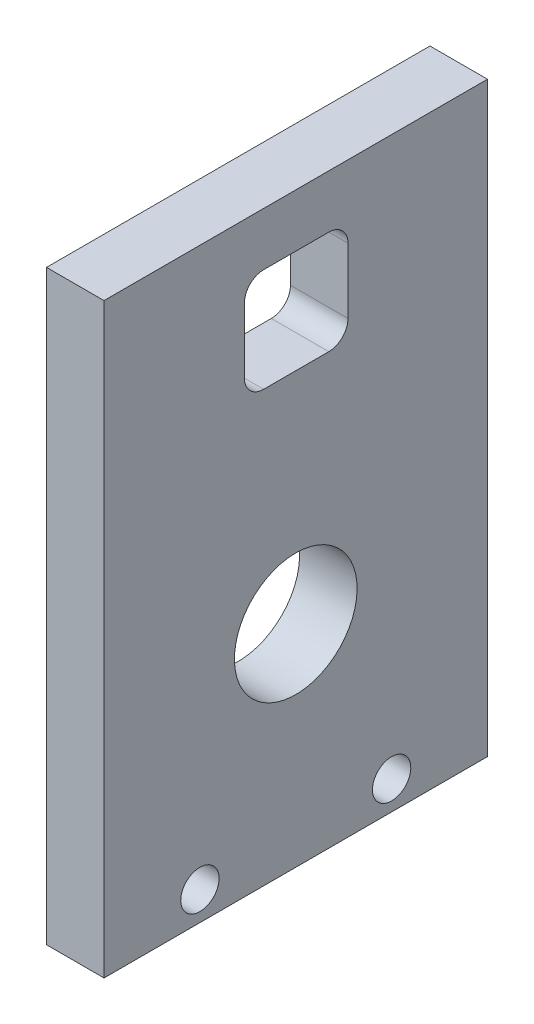
ISO-10303-21;
HEADER;
FILE_DESCRIPTION(('STEP AP214'),'2;1');
FILE_NAME('part.step','',(''),(''),'','','');
FILE_SCHEMA(('AUTOMOTIVE_DESIGN { 1 0 10303 214 1 1 1 1 }'));
ENDSEC;
DATA;
#1=APPLICATION_CONTEXT('core data for automotive mechanical design processes');
#2=APPLICATION_PROTOCOL_DEFINITION('international standard','automotive_design',2000,#1);
#3=PRODUCT_CONTEXT('',#1,'mechanical');
#4=PRODUCT('Part','Part','',(#3));
#5=PRODUCT_RELATED_PRODUCT_CATEGORY('part','',(#4));
#6=PRODUCT_DEFINITION_FORMATION('','',#4);
#7=PRODUCT_DEFINITION_CONTEXT('part definition',#1,'design');
#8=PRODUCT_DEFINITION('design','',#6,#7);
#9=PRODUCT_DEFINITION_SHAPE('','',#8);
#10=(LENGTH_UNIT() NAMED_UNIT(*) SI_UNIT(.MILLI.,.METRE.));
#11=(NAMED_UNIT(*) PLANE_ANGLE_UNIT() SI_UNIT($,.RADIAN.));
#12=(NAMED_UNIT(*) SI_UNIT($,.STERADIAN.) SOLID_ANGLE_UNIT());
#13=UNCERTAINTY_MEASURE_WITH_UNIT(LENGTH_MEASURE(1.E-05),#10,'distance_accuracy_value','');
#14=(GEOMETRIC_REPRESENTATION_CONTEXT(3) GLOBAL_UNCERTAINTY_ASSIGNED_CONTEXT((#13)) GLOBAL_UNIT_ASSIGNED_CONTEXT((#10,
#11,#12)) REPRESENTATION_CONTEXT('',''));
#15=CARTESIAN_POINT('',(0.,0.,0.));
#16=DIRECTION('',(0.,0.,1.));
#17=DIRECTION('',(1.,0.,0.));
#18=AXIS2_PLACEMENT_3D('',#15,#16,#17);
#19=CARTESIAN_POINT('',(7.49999999999999,76.5,100.));
#20=DIRECTION('',(-1.,0.,0.));
#21=DIRECTION('',(0.,-1.,0.));
#22=AXIS2_PLACEMENT_3D('',#19,#20,#21);
#23=PLANE('',#22);
#24=DIRECTION('',(0.,1.,0.));
#25=VECTOR('',#24,1.);
#26=CARTESIAN_POINT('',(7.5,40.6537026212192,36.3840944098113));
#27=LINE('',#26,#25);
#28=CARTESIAN_POINT('',(7.5,40.6537026212192,36.3840944098114));
#29=VERTEX_POINT('',#28);
#30=CARTESIAN_POINT('',(7.49999999999999,57.6537026212192,36.3840944098113));
#31=VERTEX_POINT('',#30);
#32=EDGE_CURVE('E159',#29,#31,#27,.T.);
#33=ORIENTED_EDGE('',*,*,#32,.F.);
#34=CARTESIAN_POINT('',(7.5,40.6537026212192,41.3840944098113));
#35=DIRECTION('',(1.,0.,0.));
#36=DIRECTION('',(0.,1.,0.));
#37=AXIS2_PLACEMENT_3D('',#34,#35,#36);
#38=CIRCLE('',#37,5.);
#39=CARTESIAN_POINT('',(7.5,35.6537026212192,41.3840944098114));
#40=VERTEX_POINT('',#39);
#41=EDGE_CURVE('E46',#40,#29,#38,.T.);
#42=ORIENTED_EDGE('',*,*,#41,.F.);
#43=DIRECTION('',(0.,0.,-1.));
#44=VECTOR('',#43,1.);
#45=CARTESIAN_POINT('',(7.5,35.6537026212192,58.3840944098113));
#46=LINE('',#45,#44);
#47=CARTESIAN_POINT('',(7.5,35.6537026212192,58.3840944098113));
#48=VERTEX_POINT('',#47);
#49=EDGE_CURVE('E139',#48,#40,#46,.T.);
#50=ORIENTED_EDGE('',*,*,#49,.F.);
#51=CARTESIAN_POINT('',(7.5,40.6537026212192,58.3840944098114));
#52=DIRECTION('',(1.,0.,0.));
#53=DIRECTION('',(0.,-1.,0.));
#54=AXIS2_PLACEMENT_3D('',#51,#52,#53);
#55=CIRCLE('',#54,5.);
#56=CARTESIAN_POINT('',(7.5,40.6537026212192,63.3840944098114));
#57=VERTEX_POINT('',#56);
#58=EDGE_CURVE('E142',#57,#48,#55,.T.);
#59=ORIENTED_EDGE('',*,*,#58,.F.);
#60=DIRECTION('',(0.,-1.,0.));
#61=VECTOR('',#60,1.);
#62=CARTESIAN_POINT('',(7.5,40.6537026212192,63.3840944098114));
#63=LINE('',#62,#61);
#64=CARTESIAN_POINT('',(7.49999999999999,57.6537026212192,63.3840944098114));
#65=VERTEX_POINT('',#64);
#66=EDGE_CURVE('E171',#65,#57,#63,.T.);
#67=ORIENTED_EDGE('',*,*,#66,.F.);
#68=CARTESIAN_POINT('',(7.49999999999999,57.6537026212192,58.3840944098114));
#69=DIRECTION('',(1.,0.,0.));
#70=DIRECTION('',(0.,-1.,0.));
#71=AXIS2_PLACEMENT_3D('',#68,#69,#70);
#72=CIRCLE('',#71,5.);
#73=CARTESIAN_POINT('',(7.49999999999999,62.6537026212192,58.3840944098113));
#74=VERTEX_POINT('',#73);
#75=EDGE_CURVE('E168',#74,#65,#72,.T.);
#76=ORIENTED_EDGE('',*,*,#75,.F.);
#77=DIRECTION('',(0.,0.,1.));
#78=VECTOR('',#77,1.);
#79=CARTESIAN_POINT('',(7.49999999999999,62.6537026212192,58.3840944098113));
#80=LINE('',#79,#78);
#81=CARTESIAN_POINT('',(7.49999999999999,62.6537026212192,41.3840944098114));
#82=VERTEX_POINT('',#81);
#83=EDGE_CURVE('E165',#82,#74,#80,.T.);
#84=ORIENTED_EDGE('',*,*,#83,.F.);
#85=CARTESIAN_POINT('',(7.49999999999999,57.6537026212192,41.3840944098113));
#86=DIRECTION('',(1.,0.,0.));
#87=DIRECTION('',(0.,-1.,0.));
#88=AXIS2_PLACEMENT_3D('',#85,#86,#87);
#89=CIRCLE('',#88,5.);
#90=EDGE_CURVE('E162',#31,#82,#89,.T.);
#91=ORIENTED_EDGE('',*,*,#90,.F.);
#92=EDGE_LOOP('',(#33,#42,#50,#59,#67,#76,#84,#91));
#93=FACE_BOUND('',#92,.T.);
#94=CARTESIAN_POINT('',(7.5,-21.5,50.));
#95=DIRECTION('',(1.,0.,0.));
#96=DIRECTION('',(0.,1.,0.));
#97=AXIS2_PLACEMENT_3D('',#94,#95,#96);
#98=CIRCLE('',#97,16.);
#99=CARTESIAN_POINT('',(7.5,-5.49999999999999,50.));
#100=VERTEX_POINT('',#99);
#101=EDGE_CURVE('E192',#100,#100,#98,.T.);
#102=ORIENTED_EDGE('',*,*,#101,.F.);
#103=EDGE_LOOP('',(#102));
#104=FACE_BOUND('',#103,.T.);
#105=CARTESIAN_POINT('',(7.50000000000001,-69.,75.));
#106=DIRECTION('',(1.,0.,0.));
#107=DIRECTION('',(0.,1.,0.));
#108=AXIS2_PLACEMENT_3D('',#105,#106,#107);
#109=CIRCLE('',#108,5.00000000000001);
#110=CARTESIAN_POINT('',(7.50000000000001,-64.,75.));
#111=VERTEX_POINT('',#110);
#112=EDGE_CURVE('E199',#111,#111,#109,.T.);
#113=ORIENTED_EDGE('',*,*,#112,.F.);
#114=EDGE_LOOP('',(#113));
#115=FACE_BOUND('',#114,.T.);
#116=CARTESIAN_POINT('',(7.50000000000001,-69.,25.));
#117=DIRECTION('',(1.,0.,0.));
#118=DIRECTION('',(0.,1.,0.));
#119=AXIS2_PLACEMENT_3D('',#116,#117,#118);
#120=CIRCLE('',#119,5.);
#121=CARTESIAN_POINT('',(7.50000000000001,-64.,25.));
#122=VERTEX_POINT('',#121);
#123=EDGE_CURVE('E178',#122,#122,#120,.T.);
#124=ORIENTED_EDGE('',*,*,#123,.F.);
#125=EDGE_LOOP('',(#124));
#126=FACE_BOUND('',#125,.T.);
#127=DIRECTION('',(0.,1.,0.));
#128=VECTOR('',#127,1.);
#129=CARTESIAN_POINT('',(7.49999999999999,76.5,0.));
#130=LINE('',#129,#128);
#131=CARTESIAN_POINT('',(7.50000000000001,-76.5,0.));
#132=VERTEX_POINT('',#131);
#133=CARTESIAN_POINT('',(7.49999999999999,76.5,0.));
#134=VERTEX_POINT('',#133);
#135=EDGE_CURVE('E198',#132,#134,#130,.T.);
#136=ORIENTED_EDGE('',*,*,#135,.T.);
#137=DIRECTION('',(0.,0.,-1.));
#138=VECTOR('',#137,1.);
#139=CARTESIAN_POINT('',(7.49999999999999,76.5,100.));
#140=LINE('',#139,#138);
#141=CARTESIAN_POINT('',(7.49999999999999,76.5,100.));
#142=VERTEX_POINT('',#141);
#143=EDGE_CURVE('E11',#142,#134,#140,.T.);
#144=ORIENTED_EDGE('',*,*,#143,.F.);
#145=DIRECTION('',(0.,1.,0.));
#146=VECTOR('',#145,1.);
#147=CARTESIAN_POINT('',(7.49999999999999,76.5,100.));
#148=LINE('',#147,#146);
#149=CARTESIAN_POINT('',(7.50000000000001,-76.5,100.));
#150=VERTEX_POINT('',#149);
#151=EDGE_CURVE('E207',#150,#142,#148,.T.);
#152=ORIENTED_EDGE('',*,*,#151,.F.);
#153=DIRECTION('',(0.,0.,-1.));
#154=VECTOR('',#153,1.);
#155=CARTESIAN_POINT('',(7.50000000000001,-76.5,100.));
#156=LINE('',#155,#154);
#157=EDGE_CURVE('E217',#150,#132,#156,.T.);
#158=ORIENTED_EDGE('',*,*,#157,.T.);
#159=EDGE_LOOP('',(#136,#144,#152,#158));
#160=FACE_BOUND('',#159,.T.);
#161=ADVANCED_FACE('F32',(#93,#104,#115,#126,#160),#23,.F.);
#162=CARTESIAN_POINT('',(-7.50000000000001,76.5,100.));
#163=DIRECTION('',(0.,-1.,0.));
#164=DIRECTION('',(0.,0.,-1.));
#165=AXIS2_PLACEMENT_3D('',#162,#163,#164);
#166=PLANE('',#165);
#167=DIRECTION('',(-1.,0.,0.));
#168=VECTOR('',#167,1.);
#169=CARTESIAN_POINT('',(-7.50000000000001,76.5,0.));
#170=LINE('',#169,#168);
#171=CARTESIAN_POINT('',(-7.50000000000001,76.5,0.));
#172=VERTEX_POINT('',#171);
#173=EDGE_CURVE('E220',#134,#172,#170,.T.);
#174=ORIENTED_EDGE('',*,*,#173,.T.);
#175=DIRECTION('',(0.,0.,-1.));
#176=VECTOR('',#175,1.);
#177=CARTESIAN_POINT('',(-7.50000000000001,76.5,100.));
#178=LINE('',#177,#176);
#179=CARTESIAN_POINT('',(-7.50000000000001,76.5,100.));
#180=VERTEX_POINT('',#179);
#181=EDGE_CURVE('E39',#180,#172,#178,.T.);
#182=ORIENTED_EDGE('',*,*,#181,.F.);
#183=DIRECTION('',(-1.,0.,0.));
#184=VECTOR('',#183,1.);
#185=CARTESIAN_POINT('',(-7.50000000000001,76.5,100.));
#186=LINE('',#185,#184);
#187=EDGE_CURVE('E210',#142,#180,#186,.T.);
#188=ORIENTED_EDGE('',*,*,#187,.F.);
#189=ORIENTED_EDGE('',*,*,#143,.T.);
#190=EDGE_LOOP('',(#174,#182,#188,#189));
#191=FACE_BOUND('',#190,.T.);
#192=ADVANCED_FACE('F249',(#191),#166,.F.);
#193=CARTESIAN_POINT('',(-7.50000000000001,76.5,100.));
#194=DIRECTION('',(1.,0.,0.));
#195=DIRECTION('',(0.,1.,0.));
#196=AXIS2_PLACEMENT_3D('',#193,#194,#195);
#197=PLANE('',#196);
#198=DIRECTION('',(0.,0.,-1.));
#199=VECTOR('',#198,1.);
#200=CARTESIAN_POINT('',(-7.50000000000002,35.6537026212192,58.3840944098113));
#201=LINE('',#200,#199);
#202=CARTESIAN_POINT('',(-7.50000000000002,35.6537026212192,58.3840944098113));
#203=VERTEX_POINT('',#202);
#204=CARTESIAN_POINT('',(-7.50000000000002,35.6537026212192,41.3840944098114));
#205=VERTEX_POINT('',#204);
#206=EDGE_CURVE('E128',#203,#205,#201,.T.);
#207=ORIENTED_EDGE('',*,*,#206,.T.);
#208=CARTESIAN_POINT('',(-7.50000000000002,40.6537026212192,41.3840944098113));
#209=DIRECTION('',(1.,0.,0.));
#210=DIRECTION('',(0.,1.,0.));
#211=AXIS2_PLACEMENT_3D('',#208,#209,#210);
#212=CIRCLE('',#211,5.);
#213=CARTESIAN_POINT('',(-7.50000000000002,40.6537026212192,36.3840944098113));
#214=VERTEX_POINT('',#213);
#215=EDGE_CURVE('E122',#205,#214,#212,.T.);
#216=ORIENTED_EDGE('',*,*,#215,.T.);
#217=DIRECTION('',(0.,1.,0.));
#218=VECTOR('',#217,1.);
#219=CARTESIAN_POINT('',(-7.50000000000002,40.6537026212192,36.3840944098113));
#220=LINE('',#219,#218);
#221=CARTESIAN_POINT('',(-7.50000000000001,57.6537026212192,36.3840944098114));
#222=VERTEX_POINT('',#221);
#223=EDGE_CURVE('E131',#214,#222,#220,.T.);
#224=ORIENTED_EDGE('',*,*,#223,.T.);
#225=CARTESIAN_POINT('',(-7.50000000000003,57.6537026212192,41.3840944098113));
#226=DIRECTION('',(1.,0.,0.));
#227=DIRECTION('',(0.,-1.,0.));
#228=AXIS2_PLACEMENT_3D('',#225,#226,#227);
#229=CIRCLE('',#228,5.);
#230=CARTESIAN_POINT('',(-7.50000000000003,62.6537026212192,41.3840944098114));
#231=VERTEX_POINT('',#230);
#232=EDGE_CURVE('E54',#222,#231,#229,.T.);
#233=ORIENTED_EDGE('',*,*,#232,.T.);
#234=DIRECTION('',(0.,0.,1.));
#235=VECTOR('',#234,1.);
#236=CARTESIAN_POINT('',(-7.50000000000003,62.6537026212192,58.3840944098113));
#237=LINE('',#236,#235);
#238=CARTESIAN_POINT('',(-7.50000000000003,62.6537026212192,58.3840944098113));
#239=VERTEX_POINT('',#238);
#240=EDGE_CURVE('E146',#231,#239,#237,.T.);
#241=ORIENTED_EDGE('',*,*,#240,.T.);
#242=CARTESIAN_POINT('',(-7.50000000000003,57.6537026212192,58.3840944098114));
#243=DIRECTION('',(1.,0.,0.));
#244=DIRECTION('',(0.,-1.,0.));
#245=AXIS2_PLACEMENT_3D('',#242,#243,#244);
#246=CIRCLE('',#245,5.);
#247=CARTESIAN_POINT('',(-7.50000000000003,57.6537026212192,63.3840944098114));
#248=VERTEX_POINT('',#247);
#249=EDGE_CURVE('E149',#239,#248,#246,.T.);
#250=ORIENTED_EDGE('',*,*,#249,.T.);
#251=DIRECTION('',(0.,-1.,0.));
#252=VECTOR('',#251,1.);
#253=CARTESIAN_POINT('',(-7.50000000000002,40.6537026212192,63.3840944098114));
#254=LINE('',#253,#252);
#255=CARTESIAN_POINT('',(-7.50000000000002,40.6537026212192,63.3840944098114));
#256=VERTEX_POINT('',#255);
#257=EDGE_CURVE('E152',#248,#256,#254,.T.);
#258=ORIENTED_EDGE('',*,*,#257,.T.);
#259=CARTESIAN_POINT('',(-7.50000000000002,40.6537026212192,58.3840944098114));
#260=DIRECTION('',(1.,0.,0.));
#261=DIRECTION('',(0.,-1.,0.));
#262=AXIS2_PLACEMENT_3D('',#259,#260,#261);
#263=CIRCLE('',#262,5.);
#264=EDGE_CURVE('E155',#256,#203,#263,.T.);
#265=ORIENTED_EDGE('',*,*,#264,.T.);
#266=EDGE_LOOP('',(#207,#216,#224,#233,#241,#250,#258,#265));
#267=FACE_BOUND('',#266,.T.);
#268=CARTESIAN_POINT('',(-7.50000000000002,-21.5,50.));
#269=DIRECTION('',(1.,0.,0.));
#270=DIRECTION('',(0.,1.,0.));
#271=AXIS2_PLACEMENT_3D('',#268,#269,#270);
#272=CIRCLE('',#271,16.);
#273=CARTESIAN_POINT('',(-7.50000000000002,-5.5,50.));
#274=VERTEX_POINT('',#273);
#275=EDGE_CURVE('E160',#274,#274,#272,.T.);
#276=ORIENTED_EDGE('',*,*,#275,.T.);
#277=EDGE_LOOP('',(#276));
#278=FACE_BOUND('',#277,.T.);
#279=CARTESIAN_POINT('',(-7.50000000000001,-69.,75.));
#280=DIRECTION('',(1.,0.,0.));
#281=DIRECTION('',(0.,1.,0.));
#282=AXIS2_PLACEMENT_3D('',#279,#280,#281);
#283=CIRCLE('',#282,5.00000000000001);
#284=CARTESIAN_POINT('',(-7.50000000000001,-64.,75.));
#285=VERTEX_POINT('',#284);
#286=EDGE_CURVE('E195',#285,#285,#283,.T.);
#287=ORIENTED_EDGE('',*,*,#286,.T.);
#288=EDGE_LOOP('',(#287));
#289=FACE_BOUND('',#288,.T.);
#290=CARTESIAN_POINT('',(-7.50000000000001,-69.,25.));
#291=DIRECTION('',(1.,0.,0.));
#292=DIRECTION('',(0.,1.,0.));
#293=AXIS2_PLACEMENT_3D('',#290,#291,#292);
#294=CIRCLE('',#293,5.);
#295=CARTESIAN_POINT('',(-7.50000000000001,-64.,25.));
#296=VERTEX_POINT('',#295);
#297=EDGE_CURVE('E202',#296,#296,#294,.T.);
#298=ORIENTED_EDGE('',*,*,#297,.T.);
#299=EDGE_LOOP('',(#298));
#300=FACE_BOUND('',#299,.T.);
#301=DIRECTION('',(0.,-1.,0.));
#302=VECTOR('',#301,1.);
#303=CARTESIAN_POINT('',(-7.50000000000001,76.5,0.));
#304=LINE('',#303,#302);
#305=CARTESIAN_POINT('',(-7.49999999999999,-76.5,0.));
#306=VERTEX_POINT('',#305);
#307=EDGE_CURVE('E222',#172,#306,#304,.T.);
#308=ORIENTED_EDGE('',*,*,#307,.T.);
#309=DIRECTION('',(0.,0.,-1.));
#310=VECTOR('',#309,1.);
#311=CARTESIAN_POINT('',(-7.49999999999999,-76.5,100.));
#312=LINE('',#311,#310);
#313=CARTESIAN_POINT('',(-7.49999999999999,-76.5,100.));
#314=VERTEX_POINT('',#313);
#315=EDGE_CURVE('E227',#314,#306,#312,.T.);
#316=ORIENTED_EDGE('',*,*,#315,.F.);
#317=DIRECTION('',(0.,-1.,0.));
#318=VECTOR('',#317,1.);
#319=CARTESIAN_POINT('',(-7.50000000000001,76.5,100.));
#320=LINE('',#319,#318);
#321=EDGE_CURVE('E213',#180,#314,#320,.T.);
#322=ORIENTED_EDGE('',*,*,#321,.F.);
#323=ORIENTED_EDGE('',*,*,#181,.T.);
#324=EDGE_LOOP('',(#308,#316,#322,#323));
#325=FACE_BOUND('',#324,.T.);
#326=ADVANCED_FACE('F135',(#267,#278,#289,#300,#325),#197,.F.);
#327=CARTESIAN_POINT('',(-7.49999999999999,-76.5,100.));
#328=DIRECTION('',(0.,1.,0.));
#329=DIRECTION('',(0.,0.,1.));
#330=AXIS2_PLACEMENT_3D('',#327,#328,#329);
#331=PLANE('',#330);
#332=DIRECTION('',(1.,0.,0.));
#333=VECTOR('',#332,1.);
#334=CARTESIAN_POINT('',(-7.49999999999999,-76.5,0.));
#335=LINE('',#334,#333);
#336=EDGE_CURVE('E211',#306,#132,#335,.T.);
#337=ORIENTED_EDGE('',*,*,#336,.T.);
#338=ORIENTED_EDGE('',*,*,#157,.F.);
#339=DIRECTION('',(1.,0.,0.));
#340=VECTOR('',#339,1.);
#341=CARTESIAN_POINT('',(-7.49999999999999,-76.5,100.));
#342=LINE('',#341,#340);
#343=EDGE_CURVE('E215',#314,#150,#342,.T.);
#344=ORIENTED_EDGE('',*,*,#343,.F.);
#345=ORIENTED_EDGE('',*,*,#315,.T.);
#346=EDGE_LOOP('',(#337,#338,#344,#345));
#347=FACE_BOUND('',#346,.T.);
#348=ADVANCED_FACE('F242',(#347),#331,.F.);
#349=CARTESIAN_POINT('',(0.,0.,100.));
#350=DIRECTION('',(0.,0.,1.));
#351=DIRECTION('',(1.,0.,0.));
#352=AXIS2_PLACEMENT_3D('',#349,#350,#351);
#353=PLANE('',#352);
#354=ORIENTED_EDGE('',*,*,#151,.T.);
#355=ORIENTED_EDGE('',*,*,#187,.T.);
#356=ORIENTED_EDGE('',*,*,#321,.T.);
#357=ORIENTED_EDGE('',*,*,#343,.T.);
#358=EDGE_LOOP('',(#354,#355,#356,#357));
#359=FACE_BOUND('',#358,.T.);
#360=ADVANCED_FACE('F248',(#359),#353,.T.);
#361=CARTESIAN_POINT('',(0.,0.,0.));
#362=DIRECTION('',(0.,0.,1.));
#363=DIRECTION('',(1.,0.,0.));
#364=AXIS2_PLACEMENT_3D('',#361,#362,#363);
#365=PLANE('',#364);
#366=ORIENTED_EDGE('',*,*,#135,.F.);
#367=ORIENTED_EDGE('',*,*,#336,.F.);
#368=ORIENTED_EDGE('',*,*,#307,.F.);
#369=ORIENTED_EDGE('',*,*,#173,.F.);
#370=EDGE_LOOP('',(#366,#367,#368,#369));
#371=FACE_BOUND('',#370,.T.);
#372=ADVANCED_FACE('F239',(#371),#365,.F.);
#373=CARTESIAN_POINT('',(-7.50000000000001,-69.,25.));
#374=DIRECTION('',(1.,0.,0.));
#375=DIRECTION('',(0.,1.,0.));
#376=AXIS2_PLACEMENT_3D('',#373,#374,#375);
#377=CYLINDRICAL_SURFACE('',#376,5.);
#378=ORIENTED_EDGE('',*,*,#297,.F.);
#379=EDGE_LOOP('',(#378));
#380=FACE_BOUND('',#379,.T.);
#381=ORIENTED_EDGE('',*,*,#123,.T.);
#382=EDGE_LOOP('',(#381));
#383=FACE_BOUND('',#382,.T.);
#384=ADVANCED_FACE('F262',(#380,#383),#377,.F.);
#385=CARTESIAN_POINT('',(-7.50000000000001,-69.,75.));
#386=DIRECTION('',(1.,0.,0.));
#387=DIRECTION('',(0.,1.,0.));
#388=AXIS2_PLACEMENT_3D('',#385,#386,#387);
#389=CYLINDRICAL_SURFACE('',#388,5.00000000000001);
#390=ORIENTED_EDGE('',*,*,#286,.F.);
#391=EDGE_LOOP('',(#390));
#392=FACE_BOUND('',#391,.T.);
#393=ORIENTED_EDGE('',*,*,#112,.T.);
#394=EDGE_LOOP('',(#393));
#395=FACE_BOUND('',#394,.T.);
#396=ADVANCED_FACE('F267',(#392,#395),#389,.F.);
#397=CARTESIAN_POINT('',(-7.50000000000002,-21.5,50.));
#398=DIRECTION('',(1.,0.,0.));
#399=DIRECTION('',(0.,1.,0.));
#400=AXIS2_PLACEMENT_3D('',#397,#398,#399);
#401=CYLINDRICAL_SURFACE('',#400,16.);
#402=ORIENTED_EDGE('',*,*,#275,.F.);
#403=EDGE_LOOP('',(#402));
#404=FACE_BOUND('',#403,.T.);
#405=ORIENTED_EDGE('',*,*,#101,.T.);
#406=EDGE_LOOP('',(#405));
#407=FACE_BOUND('',#406,.T.);
#408=ADVANCED_FACE('F271',(#404,#407),#401,.F.);
#409=CARTESIAN_POINT('',(-7.50000000000002,40.6537026212192,41.3840944098113));
#410=DIRECTION('',(1.,0.,0.));
#411=DIRECTION('',(0.,1.,0.));
#412=AXIS2_PLACEMENT_3D('',#409,#410,#411);
#413=CYLINDRICAL_SURFACE('',#412,5.);
#414=ORIENTED_EDGE('',*,*,#41,.T.);
#415=DIRECTION('',(1.,0.,0.));
#416=VECTOR('',#415,1.);
#417=CARTESIAN_POINT('',(-7.50000000000002,40.6537026212192,36.3840944098113));
#418=LINE('',#417,#416);
#419=EDGE_CURVE('E118',#214,#29,#418,.T.);
#420=ORIENTED_EDGE('',*,*,#419,.F.);
#421=ORIENTED_EDGE('',*,*,#215,.F.);
#422=DIRECTION('',(1.,0.,0.));
#423=VECTOR('',#422,1.);
#424=CARTESIAN_POINT('',(-7.50000000000002,35.6537026212192,41.3840944098114));
#425=LINE('',#424,#423);
#426=EDGE_CURVE('E176',#205,#40,#425,.T.);
#427=ORIENTED_EDGE('',*,*,#426,.T.);
#428=EDGE_LOOP('',(#414,#420,#421,#427));
#429=FACE_BOUND('',#428,.T.);
#430=ADVANCED_FACE('F120',(#429),#413,.F.);
#431=CARTESIAN_POINT('',(-7.50000000000002,35.6537026212192,58.3840944098113));
#432=DIRECTION('',(0.,-1.,0.));
#433=DIRECTION('',(1.,0.,0.));
#434=AXIS2_PLACEMENT_3D('',#431,#432,#433);
#435=PLANE('',#434);
#436=ORIENTED_EDGE('',*,*,#49,.T.);
#437=ORIENTED_EDGE('',*,*,#426,.F.);
#438=ORIENTED_EDGE('',*,*,#206,.F.);
#439=DIRECTION('',(1.,0.,0.));
#440=VECTOR('',#439,1.);
#441=CARTESIAN_POINT('',(-7.50000000000002,35.6537026212192,58.3840944098113));
#442=LINE('',#441,#440);
#443=EDGE_CURVE('E179',#203,#48,#442,.T.);
#444=ORIENTED_EDGE('',*,*,#443,.T.);
#445=EDGE_LOOP('',(#436,#437,#438,#444));
#446=FACE_BOUND('',#445,.T.);
#447=ADVANCED_FACE('F278',(#446),#435,.F.);
#448=CARTESIAN_POINT('',(-7.50000000000002,40.6537026212192,58.3840944098114));
#449=DIRECTION('',(1.,0.,0.));
#450=DIRECTION('',(0.,1.,0.));
#451=AXIS2_PLACEMENT_3D('',#448,#449,#450);
#452=CYLINDRICAL_SURFACE('',#451,5.);
#453=ORIENTED_EDGE('',*,*,#58,.T.);
#454=ORIENTED_EDGE('',*,*,#443,.F.);
#455=ORIENTED_EDGE('',*,*,#264,.F.);
#456=DIRECTION('',(1.,0.,0.));
#457=VECTOR('',#456,1.);
#458=CARTESIAN_POINT('',(-7.50000000000002,40.6537026212192,63.3840944098114));
#459=LINE('',#458,#457);
#460=EDGE_CURVE('E181',#256,#57,#459,.T.);
#461=ORIENTED_EDGE('',*,*,#460,.T.);
#462=EDGE_LOOP('',(#453,#454,#455,#461));
#463=FACE_BOUND('',#462,.T.);
#464=ADVANCED_FACE('F295',(#463),#452,.F.);
#465=CARTESIAN_POINT('',(-7.50000000000002,40.6537026212192,63.3840944098114));
#466=DIRECTION('',(0.,0.,1.));
#467=DIRECTION('',(1.,0.,0.));
#468=AXIS2_PLACEMENT_3D('',#465,#466,#467);
#469=PLANE('',#468);
#470=ORIENTED_EDGE('',*,*,#66,.T.);
#471=ORIENTED_EDGE('',*,*,#460,.F.);
#472=ORIENTED_EDGE('',*,*,#257,.F.);
#473=DIRECTION('',(1.,0.,0.));
#474=VECTOR('',#473,1.);
#475=CARTESIAN_POINT('',(-7.50000000000003,57.6537026212192,63.3840944098114));
#476=LINE('',#475,#474);
#477=EDGE_CURVE('E183',#248,#65,#476,.T.);
#478=ORIENTED_EDGE('',*,*,#477,.T.);
#479=EDGE_LOOP('',(#470,#471,#472,#478));
#480=FACE_BOUND('',#479,.T.);
#481=ADVANCED_FACE('F291',(#480),#469,.F.);
#482=CARTESIAN_POINT('',(-7.50000000000003,57.6537026212192,58.3840944098114));
#483=DIRECTION('',(1.,0.,0.));
#484=DIRECTION('',(0.,1.,0.));
#485=AXIS2_PLACEMENT_3D('',#482,#483,#484);
#486=CYLINDRICAL_SURFACE('',#485,5.);
#487=ORIENTED_EDGE('',*,*,#75,.T.);
#488=ORIENTED_EDGE('',*,*,#477,.F.);
#489=ORIENTED_EDGE('',*,*,#249,.F.);
#490=DIRECTION('',(1.,0.,0.));
#491=VECTOR('',#490,1.);
#492=CARTESIAN_POINT('',(-7.50000000000003,62.6537026212192,58.3840944098113));
#493=LINE('',#492,#491);
#494=EDGE_CURVE('E185',#239,#74,#493,.T.);
#495=ORIENTED_EDGE('',*,*,#494,.T.);
#496=EDGE_LOOP('',(#487,#488,#489,#495));
#497=FACE_BOUND('',#496,.T.);
#498=ADVANCED_FACE('F287',(#497),#486,.F.);
#499=CARTESIAN_POINT('',(-7.50000000000003,62.6537026212192,58.3840944098113));
#500=DIRECTION('',(0.,1.,0.));
#501=DIRECTION('',(-1.,0.,0.));
#502=AXIS2_PLACEMENT_3D('',#499,#500,#501);
#503=PLANE('',#502);
#504=ORIENTED_EDGE('',*,*,#83,.T.);
#505=ORIENTED_EDGE('',*,*,#494,.F.);
#506=ORIENTED_EDGE('',*,*,#240,.F.);
#507=DIRECTION('',(1.,0.,0.));
#508=VECTOR('',#507,1.);
#509=CARTESIAN_POINT('',(-7.50000000000003,62.6537026212192,41.3840944098114));
#510=LINE('',#509,#508);
#511=EDGE_CURVE('E187',#231,#82,#510,.T.);
#512=ORIENTED_EDGE('',*,*,#511,.T.);
#513=EDGE_LOOP('',(#504,#505,#506,#512));
#514=FACE_BOUND('',#513,.T.);
#515=ADVANCED_FACE('F284',(#514),#503,.F.);
#516=CARTESIAN_POINT('',(-7.50000000000003,57.6537026212192,41.3840944098113));
#517=DIRECTION('',(1.,0.,0.));
#518=DIRECTION('',(0.,1.,0.));
#519=AXIS2_PLACEMENT_3D('',#516,#517,#518);
#520=CYLINDRICAL_SURFACE('',#519,5.);
#521=ORIENTED_EDGE('',*,*,#90,.T.);
#522=ORIENTED_EDGE('',*,*,#511,.F.);
#523=ORIENTED_EDGE('',*,*,#232,.F.);
#524=DIRECTION('',(1.,0.,0.));
#525=VECTOR('',#524,1.);
#526=CARTESIAN_POINT('',(-7.50000000000003,57.6537026212192,36.3840944098113));
#527=LINE('',#526,#525);
#528=EDGE_CURVE('E127',#222,#31,#527,.T.);
#529=ORIENTED_EDGE('',*,*,#528,.T.);
#530=EDGE_LOOP('',(#521,#522,#523,#529));
#531=FACE_BOUND('',#530,.T.);
#532=ADVANCED_FACE('F281',(#531),#520,.F.);
#533=CARTESIAN_POINT('',(-7.50000000000002,40.6537026212192,36.3840944098113));
#534=DIRECTION('',(0.,0.,-1.));
#535=DIRECTION('',(-1.,0.,0.));
#536=AXIS2_PLACEMENT_3D('',#533,#534,#535);
#537=PLANE('',#536);
#538=ORIENTED_EDGE('',*,*,#32,.T.);
#539=ORIENTED_EDGE('',*,*,#528,.F.);
#540=ORIENTED_EDGE('',*,*,#223,.F.);
#541=ORIENTED_EDGE('',*,*,#419,.T.);
#542=EDGE_LOOP('',(#538,#539,#540,#541));
#543=FACE_BOUND('',#542,.T.);
#544=ADVANCED_FACE('F132',(#543),#537,.F.);
#545=CLOSED_SHELL('',(#161,#192,#326,#348,#360,#372,#384,#396,#408,#430,#447,#464,#481,#498,
#515,#532,#544));
#546=MANIFOLD_SOLID_BREP('B2',#545);
#547=ADVANCED_BREP_SHAPE_REPRESENTATION('',(#18,#546),#14);
#548=SHAPE_DEFINITION_REPRESENTATION(#9,#547);
ENDSEC;
END-ISO-10303-21;
